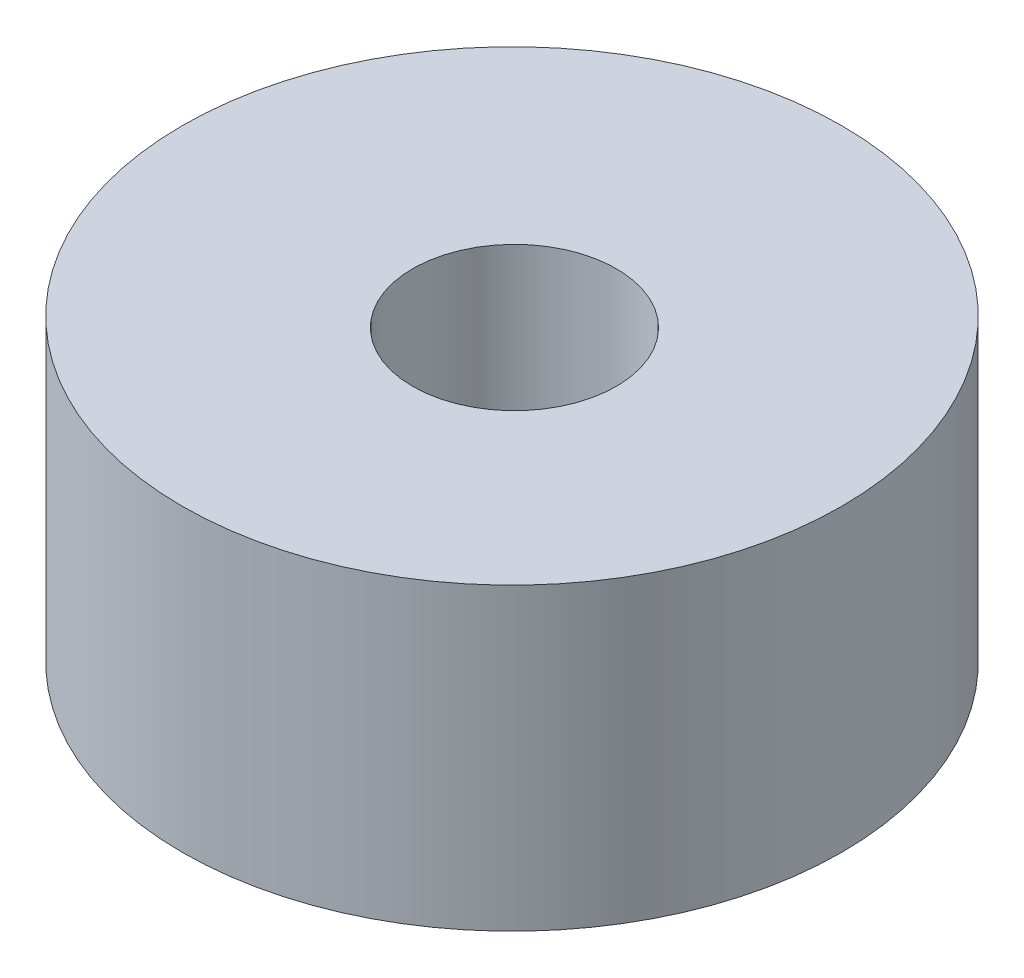
ISO-10303-21;
HEADER;
FILE_DESCRIPTION(('STEP AP214'),'2;1');
FILE_NAME('part.step','',(''),(''),'','','');
FILE_SCHEMA(('AUTOMOTIVE_DESIGN { 1 0 10303 214 1 1 1 1 }'));
ENDSEC;
DATA;
#1=APPLICATION_CONTEXT('core data for automotive mechanical design processes');
#2=APPLICATION_PROTOCOL_DEFINITION('international standard','automotive_design',2000,#1);
#3=PRODUCT_CONTEXT('',#1,'mechanical');
#4=PRODUCT('Part','Part','',(#3));
#5=PRODUCT_RELATED_PRODUCT_CATEGORY('part','',(#4));
#6=PRODUCT_DEFINITION_FORMATION('','',#4);
#7=PRODUCT_DEFINITION_CONTEXT('part definition',#1,'design');
#8=PRODUCT_DEFINITION('design','',#6,#7);
#9=PRODUCT_DEFINITION_SHAPE('','',#8);
#10=(LENGTH_UNIT() NAMED_UNIT(*) SI_UNIT(.MILLI.,.METRE.));
#11=(NAMED_UNIT(*) PLANE_ANGLE_UNIT() SI_UNIT($,.RADIAN.));
#12=(NAMED_UNIT(*) SI_UNIT($,.STERADIAN.) SOLID_ANGLE_UNIT());
#13=UNCERTAINTY_MEASURE_WITH_UNIT(LENGTH_MEASURE(1.E-05),#10,'distance_accuracy_value','');
#14=(GEOMETRIC_REPRESENTATION_CONTEXT(3) GLOBAL_UNCERTAINTY_ASSIGNED_CONTEXT((#13)) GLOBAL_UNIT_ASSIGNED_CONTEXT((#10,
#11,#12)) REPRESENTATION_CONTEXT('',''));
#15=CARTESIAN_POINT('',(0.,0.,0.));
#16=DIRECTION('',(0.,0.,1.));
#17=DIRECTION('',(1.,0.,0.));
#18=AXIS2_PLACEMENT_3D('',#15,#16,#17);
#19=CARTESIAN_POINT('',(0.,10.,0.));
#20=DIRECTION('',(0.,-1.,0.));
#21=DIRECTION('',(0.,0.,-1.));
#22=AXIS2_PLACEMENT_3D('',#19,#20,#21);
#23=CYLINDRICAL_SURFACE('',#22,11.);
#24=CARTESIAN_POINT('',(0.,10.,0.));
#25=DIRECTION('',(0.,1.,0.));
#26=DIRECTION('',(0.,0.,1.));
#27=AXIS2_PLACEMENT_3D('',#24,#25,#26);
#28=CIRCLE('',#27,11.);
#29=CARTESIAN_POINT('',(0.,10.,11.));
#30=VERTEX_POINT('',#29);
#31=EDGE_CURVE('E10',#30,#30,#28,.T.);
#32=ORIENTED_EDGE('',*,*,#31,.F.);
#33=EDGE_LOOP('',(#32));
#34=FACE_BOUND('',#33,.T.);
#35=CARTESIAN_POINT('',(0.,0.,0.));
#36=DIRECTION('',(0.,1.,0.));
#37=DIRECTION('',(0.,0.,1.));
#38=AXIS2_PLACEMENT_3D('',#35,#36,#37);
#39=CIRCLE('',#38,11.);
#40=CARTESIAN_POINT('',(0.,0.,11.));
#41=VERTEX_POINT('',#40);
#42=EDGE_CURVE('E36',#41,#41,#39,.T.);
#43=ORIENTED_EDGE('',*,*,#42,.T.);
#44=EDGE_LOOP('',(#43));
#45=FACE_BOUND('',#44,.T.);
#46=ADVANCED_FACE('F33',(#34,#45),#23,.T.);
#47=CARTESIAN_POINT('',(0.,10.,0.));
#48=DIRECTION('',(0.,1.,0.));
#49=DIRECTION('',(0.,0.,1.));
#50=AXIS2_PLACEMENT_3D('',#47,#48,#49);
#51=PLANE('',#50);
#52=CARTESIAN_POINT('',(0.375709569581772,10.,0.293209500554781));
#53=DIRECTION('',(0.,1.,0.));
#54=DIRECTION('',(0.,0.,1.));
#55=AXIS2_PLACEMENT_3D('',#52,#53,#54);
#56=CIRCLE('',#55,3.39999999999999);
#57=CARTESIAN_POINT('',(0.375709569581772,10.,3.69320950055477));
#58=VERTEX_POINT('',#57);
#59=EDGE_CURVE('E47',#58,#58,#56,.T.);
#60=ORIENTED_EDGE('',*,*,#59,.F.);
#61=EDGE_LOOP('',(#60));
#62=FACE_BOUND('',#61,.T.);
#63=ORIENTED_EDGE('',*,*,#31,.T.);
#64=EDGE_LOOP('',(#63));
#65=FACE_BOUND('',#64,.T.);
#66=ADVANCED_FACE('F53',(#62,#65),#51,.T.);
#67=CARTESIAN_POINT('',(0.,0.,0.));
#68=DIRECTION('',(0.,1.,0.));
#69=DIRECTION('',(0.,0.,1.));
#70=AXIS2_PLACEMENT_3D('',#67,#68,#69);
#71=PLANE('',#70);
#72=CARTESIAN_POINT('',(0.375709569581772,0.,0.293209500554781));
#73=DIRECTION('',(0.,1.,0.));
#74=DIRECTION('',(0.,0.,1.));
#75=AXIS2_PLACEMENT_3D('',#72,#73,#74);
#76=CIRCLE('',#75,3.4);
#77=CARTESIAN_POINT('',(0.375709569581772,0.,3.69320950055478));
#78=VERTEX_POINT('',#77);
#79=EDGE_CURVE('E43',#78,#78,#76,.T.);
#80=ORIENTED_EDGE('',*,*,#79,.T.);
#81=EDGE_LOOP('',(#80));
#82=FACE_BOUND('',#81,.T.);
#83=ORIENTED_EDGE('',*,*,#42,.F.);
#84=EDGE_LOOP('',(#83));
#85=FACE_BOUND('',#84,.T.);
#86=ADVANCED_FACE('F55',(#82,#85),#71,.F.);
#87=CARTESIAN_POINT('',(0.375709569581772,10.,0.293209500554781));
#88=DIRECTION('',(0.,1.,0.));
#89=DIRECTION('',(0.,0.,1.));
#90=AXIS2_PLACEMENT_3D('',#87,#88,#89);
#91=CYLINDRICAL_SURFACE('',#90,3.39999999999999);
#92=ORIENTED_EDGE('',*,*,#79,.F.);
#93=EDGE_LOOP('',(#92));
#94=FACE_BOUND('',#93,.T.);
#95=ORIENTED_EDGE('',*,*,#59,.T.);
#96=EDGE_LOOP('',(#95));
#97=FACE_BOUND('',#96,.T.);
#98=ADVANCED_FACE('F51',(#94,#97),#91,.F.);
#99=CLOSED_SHELL('',(#46,#66,#86,#98));
#100=MANIFOLD_SOLID_BREP('B2',#99);
#101=ADVANCED_BREP_SHAPE_REPRESENTATION('',(#18,#100),#14);
#102=SHAPE_DEFINITION_REPRESENTATION(#9,#101);
ENDSEC;
END-ISO-10303-21;
